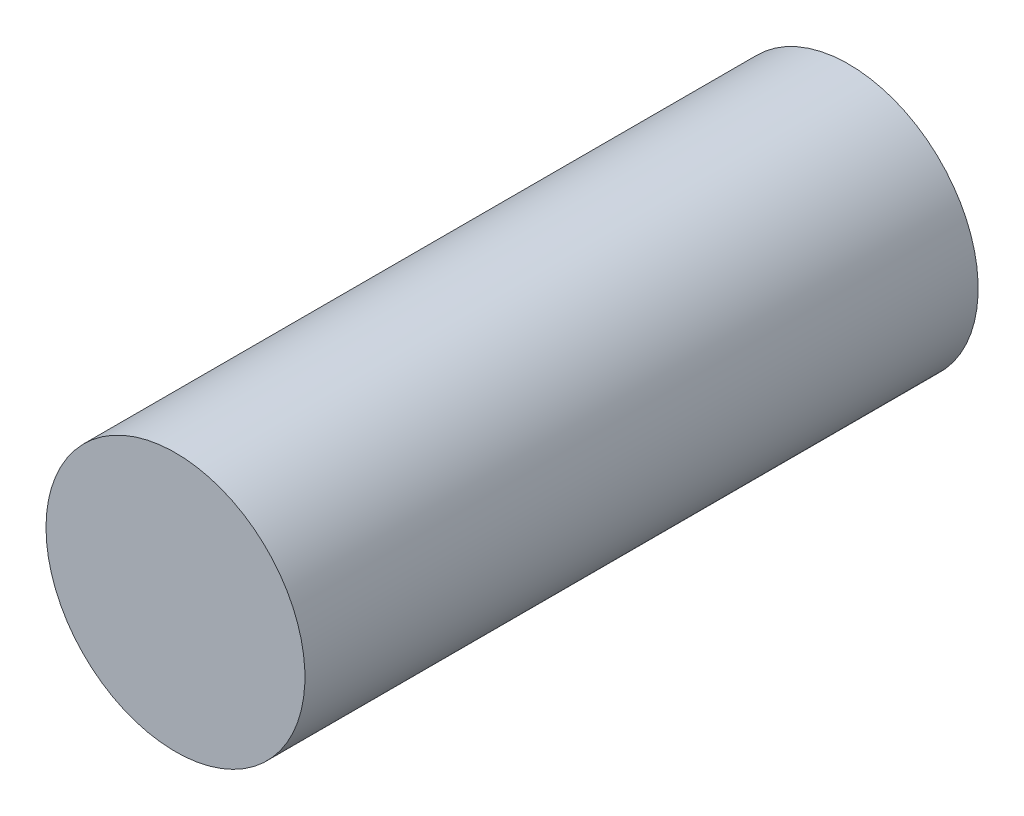
ISO-10303-21;
HEADER;
FILE_DESCRIPTION(('STEP AP214'),'2;1');
FILE_NAME('part.step','',(''),(''),'','','');
FILE_SCHEMA(('AUTOMOTIVE_DESIGN { 1 0 10303 214 1 1 1 1 }'));
ENDSEC;
DATA;
#1=APPLICATION_CONTEXT('core data for automotive mechanical design processes');
#2=APPLICATION_PROTOCOL_DEFINITION('international standard','automotive_design',2000,#1);
#3=PRODUCT_CONTEXT('',#1,'mechanical');
#4=PRODUCT('Part','Part','',(#3));
#5=PRODUCT_RELATED_PRODUCT_CATEGORY('part','',(#4));
#6=PRODUCT_DEFINITION_FORMATION('','',#4);
#7=PRODUCT_DEFINITION_CONTEXT('part definition',#1,'design');
#8=PRODUCT_DEFINITION('design','',#6,#7);
#9=PRODUCT_DEFINITION_SHAPE('','',#8);
#10=(LENGTH_UNIT() NAMED_UNIT(*) SI_UNIT(.MILLI.,.METRE.));
#11=(NAMED_UNIT(*) PLANE_ANGLE_UNIT() SI_UNIT($,.RADIAN.));
#12=(NAMED_UNIT(*) SI_UNIT($,.STERADIAN.) SOLID_ANGLE_UNIT());
#13=UNCERTAINTY_MEASURE_WITH_UNIT(LENGTH_MEASURE(1.E-05),#10,'distance_accuracy_value','');
#14=(GEOMETRIC_REPRESENTATION_CONTEXT(3) GLOBAL_UNCERTAINTY_ASSIGNED_CONTEXT((#13)) GLOBAL_UNIT_ASSIGNED_CONTEXT((#10,
#11,#12)) REPRESENTATION_CONTEXT('',''));
#15=CARTESIAN_POINT('',(0.,0.,0.));
#16=DIRECTION('',(0.,0.,1.));
#17=DIRECTION('',(1.,0.,0.));
#18=AXIS2_PLACEMENT_3D('',#15,#16,#17);
#19=CARTESIAN_POINT('',(0.15,0.,0.));
#20=DIRECTION('',(0.,0.,-1.));
#21=DIRECTION('',(-1.,0.,0.));
#22=AXIS2_PLACEMENT_3D('',#19,#20,#21);
#23=PLANE('',#22);
#24=CARTESIAN_POINT('',(0.,0.,0.));
#25=DIRECTION('',(0.,0.,-1.));
#26=DIRECTION('',(-1.,0.,0.));
#27=AXIS2_PLACEMENT_3D('',#24,#25,#26);
#28=CIRCLE('',#27,0.15);
#29=CARTESIAN_POINT('',(-0.15,0.,0.));
#30=VERTEX_POINT('',#29);
#31=EDGE_CURVE('E17',#30,#30,#28,.F.);
#32=ORIENTED_EDGE('',*,*,#31,.F.);
#33=EDGE_LOOP('',(#32));
#34=FACE_BOUND('',#33,.T.);
#35=ADVANCED_FACE('F14',(#34),#23,.T.);
#36=CARTESIAN_POINT('',(0.15,0.,0.78));
#37=DIRECTION('',(0.,0.,-1.));
#38=DIRECTION('',(-1.,0.,0.));
#39=AXIS2_PLACEMENT_3D('',#36,#37,#38);
#40=PLANE('',#39);
#41=CARTESIAN_POINT('',(0.,0.,0.78));
#42=DIRECTION('',(0.,0.,-1.));
#43=DIRECTION('',(-1.,0.,0.));
#44=AXIS2_PLACEMENT_3D('',#41,#42,#43);
#45=CIRCLE('',#44,0.15);
#46=CARTESIAN_POINT('',(-0.15,0.,0.78));
#47=VERTEX_POINT('',#46);
#48=EDGE_CURVE('E10',#47,#47,#45,.T.);
#49=ORIENTED_EDGE('',*,*,#48,.F.);
#50=EDGE_LOOP('',(#49));
#51=FACE_BOUND('',#50,.T.);
#52=ADVANCED_FACE('F35',(#51),#40,.F.);
#53=CARTESIAN_POINT('',(0.,0.,0.));
#54=DIRECTION('',(0.,0.,-1.));
#55=DIRECTION('',(-1.,0.,0.));
#56=AXIS2_PLACEMENT_3D('',#53,#54,#55);
#57=CYLINDRICAL_SURFACE('',#56,0.15);
#58=ORIENTED_EDGE('',*,*,#31,.T.);
#59=EDGE_LOOP('',(#58));
#60=FACE_BOUND('',#59,.T.);
#61=ORIENTED_EDGE('',*,*,#48,.T.);
#62=EDGE_LOOP('',(#61));
#63=FACE_BOUND('',#62,.T.);
#64=ADVANCED_FACE('F32',(#60,#63),#57,.T.);
#65=CLOSED_SHELL('',(#35,#52,#64));
#66=MANIFOLD_SOLID_BREP('B1',#65);
#67=ADVANCED_BREP_SHAPE_REPRESENTATION('',(#18,#66),#14);
#68=SHAPE_DEFINITION_REPRESENTATION(#9,#67);
ENDSEC;
END-ISO-10303-21;
